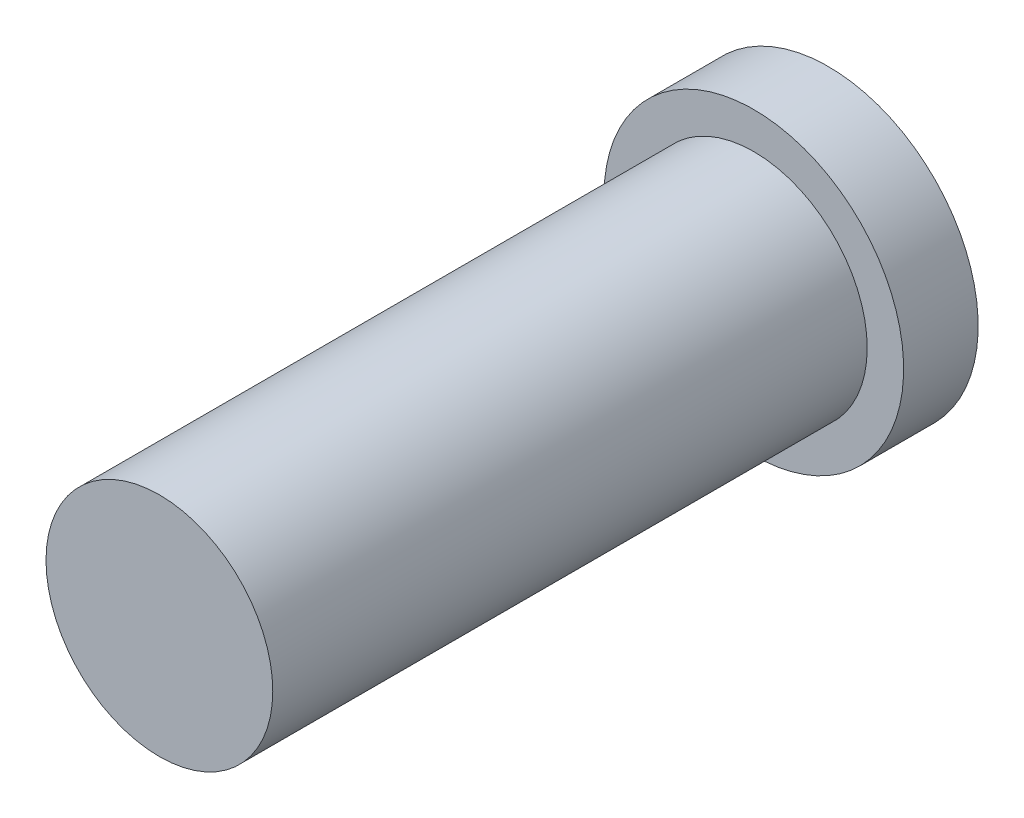
ISO-10303-21;
HEADER;
FILE_DESCRIPTION(('STEP AP214'),'2;1');
FILE_NAME('part.step','',(''),(''),'','','');
FILE_SCHEMA(('AUTOMOTIVE_DESIGN { 1 0 10303 214 1 1 1 1 }'));
ENDSEC;
DATA;
#1=APPLICATION_CONTEXT('core data for automotive mechanical design processes');
#2=APPLICATION_PROTOCOL_DEFINITION('international standard','automotive_design',2000,#1);
#3=PRODUCT_CONTEXT('',#1,'mechanical');
#4=PRODUCT('Part','Part','',(#3));
#5=PRODUCT_RELATED_PRODUCT_CATEGORY('part','',(#4));
#6=PRODUCT_DEFINITION_FORMATION('','',#4);
#7=PRODUCT_DEFINITION_CONTEXT('part definition',#1,'design');
#8=PRODUCT_DEFINITION('design','',#6,#7);
#9=PRODUCT_DEFINITION_SHAPE('','',#8);
#10=(LENGTH_UNIT() NAMED_UNIT(*) SI_UNIT(.MILLI.,.METRE.));
#11=(NAMED_UNIT(*) PLANE_ANGLE_UNIT() SI_UNIT($,.RADIAN.));
#12=(NAMED_UNIT(*) SI_UNIT($,.STERADIAN.) SOLID_ANGLE_UNIT());
#13=UNCERTAINTY_MEASURE_WITH_UNIT(LENGTH_MEASURE(1.E-05),#10,'distance_accuracy_value','');
#14=(GEOMETRIC_REPRESENTATION_CONTEXT(3) GLOBAL_UNCERTAINTY_ASSIGNED_CONTEXT((#13)) GLOBAL_UNIT_ASSIGNED_CONTEXT((#10,
#11,#12)) REPRESENTATION_CONTEXT('',''));
#15=CARTESIAN_POINT('',(0.,0.,0.));
#16=DIRECTION('',(0.,0.,1.));
#17=DIRECTION('',(1.,0.,0.));
#18=AXIS2_PLACEMENT_3D('',#15,#16,#17);
#19=CARTESIAN_POINT('',(0.,0.,3.67));
#20=DIRECTION('',(0.,0.,-1.));
#21=DIRECTION('',(-1.,0.,0.));
#22=AXIS2_PLACEMENT_3D('',#19,#20,#21);
#23=CYLINDRICAL_SURFACE('',#22,0.7);
#24=CARTESIAN_POINT('',(0.,0.,3.67));
#25=DIRECTION('',(0.,0.,1.));
#26=DIRECTION('',(1.,0.,0.));
#27=AXIS2_PLACEMENT_3D('',#24,#25,#26);
#28=CIRCLE('',#27,0.7);
#29=CARTESIAN_POINT('',(0.7,0.,3.67));
#30=VERTEX_POINT('',#29);
#31=EDGE_CURVE('E10',#30,#30,#28,.T.);
#32=ORIENTED_EDGE('',*,*,#31,.F.);
#33=EDGE_LOOP('',(#32));
#34=FACE_BOUND('',#33,.T.);
#35=CARTESIAN_POINT('',(0.,0.,0.));
#36=DIRECTION('',(0.,0.,-1.));
#37=DIRECTION('',(-1.,0.,0.));
#38=AXIS2_PLACEMENT_3D('',#35,#36,#37);
#39=CIRCLE('',#38,0.7);
#40=CARTESIAN_POINT('',(-0.7,0.,0.));
#41=VERTEX_POINT('',#40);
#42=EDGE_CURVE('E36',#41,#41,#39,.T.);
#43=ORIENTED_EDGE('',*,*,#42,.F.);
#44=EDGE_LOOP('',(#43));
#45=FACE_BOUND('',#44,.T.);
#46=ADVANCED_FACE('F30',(#34,#45),#23,.T.);
#47=CARTESIAN_POINT('',(0.,0.,3.67));
#48=DIRECTION('',(0.,0.,1.));
#49=DIRECTION('',(1.,0.,0.));
#50=AXIS2_PLACEMENT_3D('',#47,#48,#49);
#51=PLANE('',#50);
#52=ORIENTED_EDGE('',*,*,#31,.T.);
#53=EDGE_LOOP('',(#52));
#54=FACE_BOUND('',#53,.T.);
#55=ADVANCED_FACE('F78',(#54),#51,.T.);
#56=CARTESIAN_POINT('',(0.,0.,0.));
#57=DIRECTION('',(0.,0.,-1.));
#58=DIRECTION('',(-1.,0.,0.));
#59=AXIS2_PLACEMENT_3D('',#56,#57,#58);
#60=PLANE('',#59);
#61=CARTESIAN_POINT('',(0.,0.,0.));
#62=DIRECTION('',(0.,0.,-1.));
#63=DIRECTION('',(-1.,0.,0.));
#64=AXIS2_PLACEMENT_3D('',#61,#62,#63);
#65=CIRCLE('',#64,0.925);
#66=CARTESIAN_POINT('',(-0.925,0.,0.));
#67=VERTEX_POINT('',#66);
#68=EDGE_CURVE('E44',#67,#67,#65,.T.);
#69=ORIENTED_EDGE('',*,*,#68,.F.);
#70=EDGE_LOOP('',(#69));
#71=FACE_BOUND('',#70,.T.);
#72=ORIENTED_EDGE('',*,*,#42,.T.);
#73=EDGE_LOOP('',(#72));
#74=FACE_BOUND('',#73,.T.);
#75=ADVANCED_FACE('F73',(#71,#74),#60,.F.);
#76=CARTESIAN_POINT('',(0.,0.,-0.46));
#77=DIRECTION('',(0.,0.,1.));
#78=DIRECTION('',(1.,0.,0.));
#79=AXIS2_PLACEMENT_3D('',#76,#77,#78);
#80=CYLINDRICAL_SURFACE('',#79,0.925);
#81=CARTESIAN_POINT('',(0.,0.,-0.46));
#82=DIRECTION('',(0.,0.,-1.));
#83=DIRECTION('',(-1.,0.,0.));
#84=AXIS2_PLACEMENT_3D('',#81,#82,#83);
#85=CIRCLE('',#84,0.925);
#86=CARTESIAN_POINT('',(-0.925,0.,-0.46));
#87=VERTEX_POINT('',#86);
#88=EDGE_CURVE('E40',#87,#87,#85,.T.);
#89=ORIENTED_EDGE('',*,*,#88,.F.);
#90=EDGE_LOOP('',(#89));
#91=FACE_BOUND('',#90,.T.);
#92=ORIENTED_EDGE('',*,*,#68,.T.);
#93=EDGE_LOOP('',(#92));
#94=FACE_BOUND('',#93,.T.);
#95=ADVANCED_FACE('F67',(#91,#94),#80,.T.);
#96=CARTESIAN_POINT('',(0.,0.,-0.46));
#97=DIRECTION('',(0.,0.,-1.));
#98=DIRECTION('',(-1.,0.,0.));
#99=AXIS2_PLACEMENT_3D('',#96,#97,#98);
#100=PLANE('',#99);
#101=CARTESIAN_POINT('',(0.,0.,-0.46));
#102=DIRECTION('',(0.,0.,-1.));
#103=DIRECTION('',(-1.,0.,0.));
#104=AXIS2_PLACEMENT_3D('',#101,#102,#103);
#105=CIRCLE('',#104,0.455);
#106=CARTESIAN_POINT('',(-0.455,0.,-0.46));
#107=VERTEX_POINT('',#106);
#108=EDGE_CURVE('E50',#107,#107,#105,.T.);
#109=ORIENTED_EDGE('',*,*,#108,.F.);
#110=EDGE_LOOP('',(#109));
#111=FACE_BOUND('',#110,.T.);
#112=ORIENTED_EDGE('',*,*,#88,.T.);
#113=EDGE_LOOP('',(#112));
#114=FACE_BOUND('',#113,.T.);
#115=ADVANCED_FACE('F61',(#111,#114),#100,.T.);
#116=CARTESIAN_POINT('',(0.,0.,3.04));
#117=DIRECTION('',(0.,0.,-1.));
#118=DIRECTION('',(-1.,0.,0.));
#119=AXIS2_PLACEMENT_3D('',#116,#117,#118);
#120=CYLINDRICAL_SURFACE('',#119,0.455);
#121=CARTESIAN_POINT('',(0.,0.,3.04));
#122=DIRECTION('',(0.,0.,-1.));
#123=DIRECTION('',(-1.,0.,0.));
#124=AXIS2_PLACEMENT_3D('',#121,#122,#123);
#125=CIRCLE('',#124,0.455);
#126=CARTESIAN_POINT('',(-0.455,0.,3.04));
#127=VERTEX_POINT('',#126);
#128=EDGE_CURVE('E48',#127,#127,#125,.T.);
#129=ORIENTED_EDGE('',*,*,#128,.F.);
#130=EDGE_LOOP('',(#129));
#131=FACE_BOUND('',#130,.T.);
#132=ORIENTED_EDGE('',*,*,#108,.T.);
#133=EDGE_LOOP('',(#132));
#134=FACE_BOUND('',#133,.T.);
#135=ADVANCED_FACE('F58',(#131,#134),#120,.F.);
#136=CARTESIAN_POINT('',(0.,0.,3.04));
#137=DIRECTION('',(0.,0.,-1.));
#138=DIRECTION('',(-1.,0.,0.));
#139=AXIS2_PLACEMENT_3D('',#136,#137,#138);
#140=PLANE('',#139);
#141=ORIENTED_EDGE('',*,*,#128,.T.);
#142=EDGE_LOOP('',(#141));
#143=FACE_BOUND('',#142,.T.);
#144=ADVANCED_FACE('F56',(#143),#140,.T.);
#145=CLOSED_SHELL('',(#46,#55,#75,#95,#115,#135,#144));
#146=MANIFOLD_SOLID_BREP('B2',#145);
#147=ADVANCED_BREP_SHAPE_REPRESENTATION('',(#18,#146),#14);
#148=SHAPE_DEFINITION_REPRESENTATION(#9,#147);
ENDSEC;
END-ISO-10303-21;
